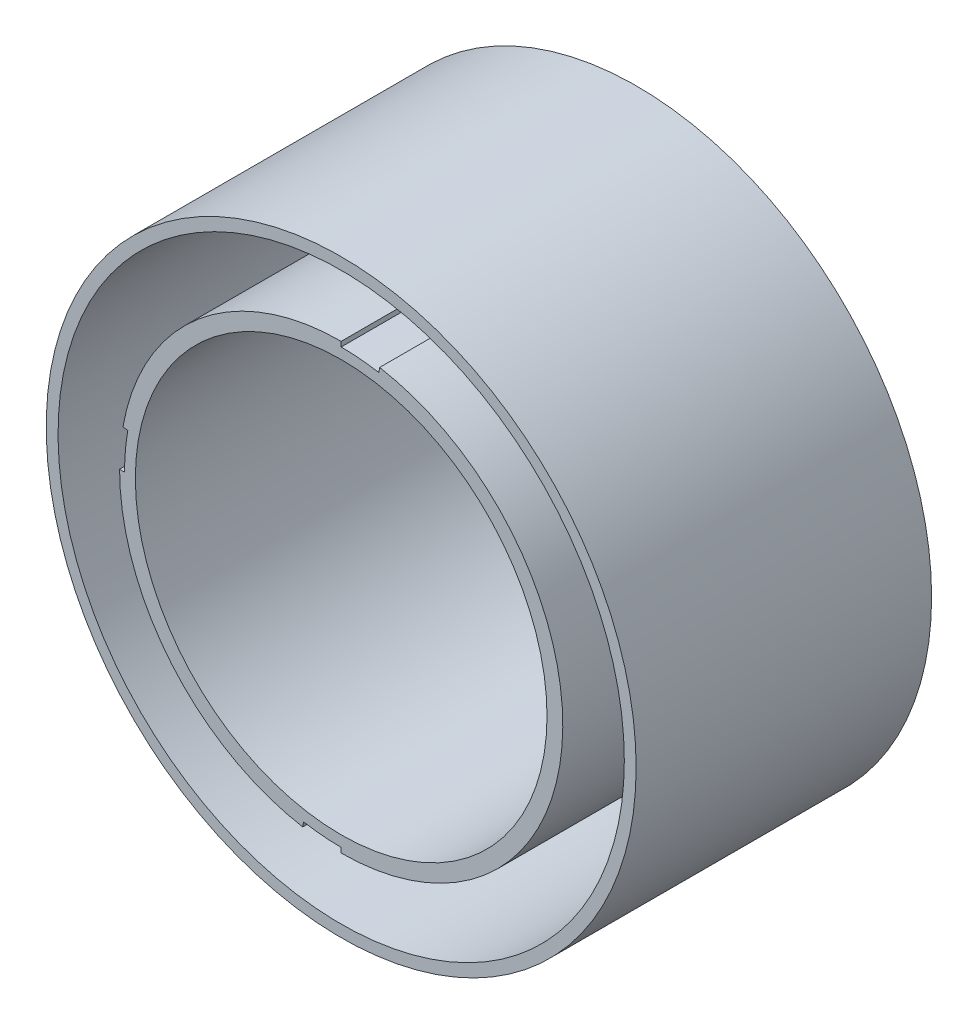
ISO-10303-21;
HEADER;
FILE_DESCRIPTION(('STEP AP214'),'2;1');
FILE_NAME('part.step','',(''),(''),'','','');
FILE_SCHEMA(('AUTOMOTIVE_DESIGN { 1 0 10303 214 1 1 1 1 }'));
ENDSEC;
DATA;
#1=APPLICATION_CONTEXT('core data for automotive mechanical design processes');
#2=APPLICATION_PROTOCOL_DEFINITION('international standard','automotive_design',2000,#1);
#3=PRODUCT_CONTEXT('',#1,'mechanical');
#4=PRODUCT('Part','Part','',(#3));
#5=PRODUCT_RELATED_PRODUCT_CATEGORY('part','',(#4));
#6=PRODUCT_DEFINITION_FORMATION('','',#4);
#7=PRODUCT_DEFINITION_CONTEXT('part definition',#1,'design');
#8=PRODUCT_DEFINITION('design','',#6,#7);
#9=PRODUCT_DEFINITION_SHAPE('','',#8);
#10=(LENGTH_UNIT() NAMED_UNIT(*) SI_UNIT(.MILLI.,.METRE.));
#11=(NAMED_UNIT(*) PLANE_ANGLE_UNIT() SI_UNIT($,.RADIAN.));
#12=(NAMED_UNIT(*) SI_UNIT($,.STERADIAN.) SOLID_ANGLE_UNIT());
#13=UNCERTAINTY_MEASURE_WITH_UNIT(LENGTH_MEASURE(1.E-05),#10,'distance_accuracy_value','');
#14=(GEOMETRIC_REPRESENTATION_CONTEXT(3) GLOBAL_UNCERTAINTY_ASSIGNED_CONTEXT((#13)) GLOBAL_UNIT_ASSIGNED_CONTEXT((#10,
#11,#12)) REPRESENTATION_CONTEXT('',''));
#15=CARTESIAN_POINT('',(0.,0.,0.));
#16=DIRECTION('',(0.,0.,1.));
#17=DIRECTION('',(1.,0.,0.));
#18=AXIS2_PLACEMENT_3D('',#15,#16,#17);
#19=CARTESIAN_POINT('',(0.,0.,30.));
#20=DIRECTION('',(0.,0.,-1.));
#21=DIRECTION('',(-1.,0.,0.));
#22=AXIS2_PLACEMENT_3D('',#19,#20,#21);
#23=CYLINDRICAL_SURFACE('',#22,28.75);
#24=CARTESIAN_POINT('',(0.,0.,30.));
#25=DIRECTION('',(0.,0.,1.));
#26=DIRECTION('',(1.,0.,0.));
#27=AXIS2_PLACEMENT_3D('',#24,#25,#26);
#28=CIRCLE('',#27,28.75);
#29=CARTESIAN_POINT('',(28.75,0.,30.));
#30=VERTEX_POINT('',#29);
#31=EDGE_CURVE('E56',#30,#30,#28,.T.);
#32=ORIENTED_EDGE('',*,*,#31,.T.);
#33=EDGE_LOOP('',(#32));
#34=FACE_BOUND('',#33,.T.);
#35=CARTESIAN_POINT('',(0.,0.,0.));
#36=DIRECTION('',(0.,0.,1.));
#37=DIRECTION('',(1.,0.,0.));
#38=AXIS2_PLACEMENT_3D('',#35,#36,#37);
#39=CIRCLE('',#38,28.75);
#40=CARTESIAN_POINT('',(-22.9600254219505,17.3031711724582,0.));
#41=VERTEX_POINT('',#40);
#42=CARTESIAN_POINT('',(-22.9600254219505,-17.3031711724582,0.));
#43=VERTEX_POINT('',#42);
#44=EDGE_CURVE('E527',#41,#43,#39,.T.);
#45=ORIENTED_EDGE('',*,*,#44,.F.);
#46=DIRECTION('',(0.,0.,-1.));
#47=VECTOR('',#46,1.);
#48=CARTESIAN_POINT('',(-22.9600254219505,17.3031711724582,30.));
#49=LINE('',#48,#47);
#50=CARTESIAN_POINT('',(-22.9600254219505,17.3031711724582,4.));
#51=VERTEX_POINT('',#50);
#52=EDGE_CURVE('E259',#41,#51,#49,.F.);
#53=ORIENTED_EDGE('',*,*,#52,.T.);
#54=CARTESIAN_POINT('',(0.,0.,4.));
#55=DIRECTION('',(0.,0.,-1.));
#56=DIRECTION('',(-1.,0.,0.));
#57=AXIS2_PLACEMENT_3D('',#54,#55,#56);
#58=CIRCLE('',#57,28.75);
#59=CARTESIAN_POINT('',(-17.3031711724581,22.9600254219506,4.));
#60=VERTEX_POINT('',#59);
#61=EDGE_CURVE('E255',#51,#60,#58,.T.);
#62=ORIENTED_EDGE('',*,*,#61,.T.);
#63=DIRECTION('',(0.,0.,-1.));
#64=VECTOR('',#63,1.);
#65=CARTESIAN_POINT('',(-17.3031711724581,22.9600254219506,30.));
#66=LINE('',#65,#64);
#67=CARTESIAN_POINT('',(-17.3031711724581,22.9600254219506,0.));
#68=VERTEX_POINT('',#67);
#69=EDGE_CURVE('E278',#60,#68,#66,.T.);
#70=ORIENTED_EDGE('',*,*,#69,.T.);
#71=CARTESIAN_POINT('',(17.3031711724581,22.9600254219506,0.));
#72=VERTEX_POINT('',#71);
#73=EDGE_CURVE('E524',#72,#68,#39,.T.);
#74=ORIENTED_EDGE('',*,*,#73,.F.);
#75=DIRECTION('',(0.,0.,-1.));
#76=VECTOR('',#75,1.);
#77=CARTESIAN_POINT('',(17.3031711724581,22.9600254219506,30.));
#78=LINE('',#77,#76);
#79=CARTESIAN_POINT('',(17.3031711724581,22.9600254219506,4.));
#80=VERTEX_POINT('',#79);
#81=EDGE_CURVE('E513',#80,#72,#78,.T.);
#82=ORIENTED_EDGE('',*,*,#81,.F.);
#83=CARTESIAN_POINT('',(0.,0.,4.));
#84=DIRECTION('',(0.,0.,-1.));
#85=DIRECTION('',(-1.,0.,0.));
#86=AXIS2_PLACEMENT_3D('',#83,#84,#85);
#87=CIRCLE('',#86,28.75);
#88=CARTESIAN_POINT('',(22.9600254219505,17.3031711724582,4.));
#89=VERTEX_POINT('',#88);
#90=EDGE_CURVE('E517',#80,#89,#87,.T.);
#91=ORIENTED_EDGE('',*,*,#90,.T.);
#92=DIRECTION('',(0.,0.,-1.));
#93=VECTOR('',#92,1.);
#94=CARTESIAN_POINT('',(22.9600254219505,17.3031711724582,30.));
#95=LINE('',#94,#93);
#96=CARTESIAN_POINT('',(22.9600254219505,17.3031711724582,0.));
#97=VERTEX_POINT('',#96);
#98=EDGE_CURVE('E507',#97,#89,#95,.F.);
#99=ORIENTED_EDGE('',*,*,#98,.F.);
#100=CARTESIAN_POINT('',(22.9600254219505,-17.3031711724582,0.));
#101=VERTEX_POINT('',#100);
#102=EDGE_CURVE('E521',#101,#97,#39,.T.);
#103=ORIENTED_EDGE('',*,*,#102,.F.);
#104=DIRECTION('',(0.,0.,-1.));
#105=VECTOR('',#104,1.);
#106=CARTESIAN_POINT('',(22.9600254219505,-17.3031711724582,30.));
#107=LINE('',#106,#105);
#108=CARTESIAN_POINT('',(22.9600254219505,-17.3031711724582,4.));
#109=VERTEX_POINT('',#108);
#110=EDGE_CURVE('E358',#101,#109,#107,.F.);
#111=ORIENTED_EDGE('',*,*,#110,.T.);
#112=CARTESIAN_POINT('',(0.,0.,4.));
#113=DIRECTION('',(0.,0.,-1.));
#114=DIRECTION('',(-1.,0.,0.));
#115=AXIS2_PLACEMENT_3D('',#112,#113,#114);
#116=CIRCLE('',#115,28.75);
#117=CARTESIAN_POINT('',(17.3031711724581,-22.9600254219505,4.));
#118=VERTEX_POINT('',#117);
#119=EDGE_CURVE('E347',#109,#118,#116,.T.);
#120=ORIENTED_EDGE('',*,*,#119,.T.);
#121=DIRECTION('',(0.,0.,-1.));
#122=VECTOR('',#121,1.);
#123=CARTESIAN_POINT('',(17.3031711724581,-22.9600254219505,30.));
#124=LINE('',#123,#122);
#125=CARTESIAN_POINT('',(17.3031711724581,-22.9600254219505,0.));
#126=VERTEX_POINT('',#125);
#127=EDGE_CURVE('E354',#118,#126,#124,.T.);
#128=ORIENTED_EDGE('',*,*,#127,.T.);
#129=CARTESIAN_POINT('',(-17.3031711724581,-22.9600254219505,0.));
#130=VERTEX_POINT('',#129);
#131=EDGE_CURVE('E534',#130,#126,#39,.T.);
#132=ORIENTED_EDGE('',*,*,#131,.F.);
#133=DIRECTION('',(0.,0.,-1.));
#134=VECTOR('',#133,1.);
#135=CARTESIAN_POINT('',(-17.3031711724581,-22.9600254219505,30.));
#136=LINE('',#135,#134);
#137=CARTESIAN_POINT('',(-17.3031711724581,-22.9600254219505,4.));
#138=VERTEX_POINT('',#137);
#139=EDGE_CURVE('E315',#138,#130,#136,.T.);
#140=ORIENTED_EDGE('',*,*,#139,.F.);
#141=CARTESIAN_POINT('',(0.,0.,4.));
#142=DIRECTION('',(0.,0.,-1.));
#143=DIRECTION('',(-1.,0.,0.));
#144=AXIS2_PLACEMENT_3D('',#141,#142,#143);
#145=CIRCLE('',#144,28.75);
#146=CARTESIAN_POINT('',(-22.9600254219505,-17.3031711724582,4.));
#147=VERTEX_POINT('',#146);
#148=EDGE_CURVE('E308',#138,#147,#145,.T.);
#149=ORIENTED_EDGE('',*,*,#148,.T.);
#150=DIRECTION('',(0.,0.,-1.));
#151=VECTOR('',#150,1.);
#152=CARTESIAN_POINT('',(-22.9600254219505,-17.3031711724582,30.));
#153=LINE('',#152,#151);
#154=EDGE_CURVE('E319',#43,#147,#153,.F.);
#155=ORIENTED_EDGE('',*,*,#154,.F.);
#156=EDGE_LOOP('',(#45,#53,#62,#70,#74,#82,#91,#99,#103,#111,#120,#128,#132,#140,#149,#155));
#157=FACE_BOUND('',#156,.T.);
#158=ADVANCED_FACE('F47',(#34,#157),#23,.F.);
#159=CARTESIAN_POINT('',(0.,0.,30.));
#160=DIRECTION('',(0.,0.,-1.));
#161=DIRECTION('',(-1.,0.,0.));
#162=AXIS2_PLACEMENT_3D('',#159,#160,#161);
#163=CYLINDRICAL_SURFACE('',#162,22.5);
#164=DIRECTION('',(0.,0.,-1.));
#165=VECTOR('',#164,1.);
#166=CARTESIAN_POINT('',(-18.4848954365973,12.828041187105,4.));
#167=LINE('',#166,#165);
#168=CARTESIAN_POINT('',(-18.4848954365973,12.828041187105,4.));
#169=VERTEX_POINT('',#168);
#170=CARTESIAN_POINT('',(-18.4848954365973,12.828041187105,0.));
#171=VERTEX_POINT('',#170);
#172=EDGE_CURVE('E248',#169,#171,#167,.T.);
#173=ORIENTED_EDGE('',*,*,#172,.T.);
#174=CARTESIAN_POINT('',(0.,0.,0.));
#175=DIRECTION('',(0.,0.,1.));
#176=DIRECTION('',(1.,0.,0.));
#177=AXIS2_PLACEMENT_3D('',#174,#175,#176);
#178=CIRCLE('',#177,22.5);
#179=CARTESIAN_POINT('',(-22.1581744427747,3.90708399750594,0.));
#180=VERTEX_POINT('',#179);
#181=EDGE_CURVE('E232',#171,#180,#178,.T.);
#182=ORIENTED_EDGE('',*,*,#181,.T.);
#183=DIRECTION('',(0.,0.,1.));
#184=VECTOR('',#183,1.);
#185=CARTESIAN_POINT('',(-22.1581744427747,3.90708399750594,0.));
#186=LINE('',#185,#184);
#187=CARTESIAN_POINT('',(-22.1581744427747,3.90708399750594,30.));
#188=VERTEX_POINT('',#187);
#189=EDGE_CURVE('E437',#180,#188,#186,.T.);
#190=ORIENTED_EDGE('',*,*,#189,.T.);
#191=CARTESIAN_POINT('',(0.,0.,30.));
#192=DIRECTION('',(0.,0.,1.));
#193=DIRECTION('',(1.,0.,0.));
#194=AXIS2_PLACEMENT_3D('',#191,#192,#193);
#195=CIRCLE('',#194,22.5);
#196=CARTESIAN_POINT('',(0.,22.5,30.));
#197=VERTEX_POINT('',#196);
#198=EDGE_CURVE('E477',#197,#188,#195,.T.);
#199=ORIENTED_EDGE('',*,*,#198,.F.);
#200=DIRECTION('',(0.,0.,1.));
#201=VECTOR('',#200,1.);
#202=CARTESIAN_POINT('',(0.,22.5,0.));
#203=LINE('',#202,#201);
#204=CARTESIAN_POINT('',(0.,22.5,0.));
#205=VERTEX_POINT('',#204);
#206=EDGE_CURVE('E388',#205,#197,#203,.T.);
#207=ORIENTED_EDGE('',*,*,#206,.F.);
#208=CARTESIAN_POINT('',(-12.828041187105,18.4848954365974,0.));
#209=VERTEX_POINT('',#208);
#210=EDGE_CURVE('E242',#205,#209,#178,.T.);
#211=ORIENTED_EDGE('',*,*,#210,.T.);
#212=DIRECTION('',(0.,0.,-1.));
#213=VECTOR('',#212,1.);
#214=CARTESIAN_POINT('',(-12.828041187105,18.4848954365974,4.));
#215=LINE('',#214,#213);
#216=CARTESIAN_POINT('',(-12.828041187105,18.4848954365974,4.));
#217=VERTEX_POINT('',#216);
#218=EDGE_CURVE('E72',#217,#209,#215,.T.);
#219=ORIENTED_EDGE('',*,*,#218,.F.);
#220=CARTESIAN_POINT('',(0.,0.,4.));
#221=DIRECTION('',(0.,0.,-1.));
#222=DIRECTION('',(-1.,0.,0.));
#223=AXIS2_PLACEMENT_3D('',#220,#221,#222);
#224=CIRCLE('',#223,22.5);
#225=EDGE_CURVE('E250',#169,#217,#224,.T.);
#226=ORIENTED_EDGE('',*,*,#225,.F.);
#227=EDGE_LOOP('',(#173,#182,#190,#199,#207,#211,#219,#226));
#228=FACE_BOUND('',#227,.T.);
#229=ADVANCED_FACE('F249',(#228),#163,.T.);
#230=DIRECTION('',(0.,0.,-1.));
#231=VECTOR('',#230,1.);
#232=CARTESIAN_POINT('',(18.4848954365973,-12.828041187105,4.));
#233=LINE('',#232,#231);
#234=CARTESIAN_POINT('',(18.4848954365973,-12.828041187105,4.));
#235=VERTEX_POINT('',#234);
#236=CARTESIAN_POINT('',(18.4848954365973,-12.828041187105,0.));
#237=VERTEX_POINT('',#236);
#238=EDGE_CURVE('E343',#235,#237,#233,.T.);
#239=ORIENTED_EDGE('',*,*,#238,.T.);
#240=CARTESIAN_POINT('',(18.4848954365973,12.828041187105,0.));
#241=VERTEX_POINT('',#240);
#242=EDGE_CURVE('E483',#237,#241,#178,.T.);
#243=ORIENTED_EDGE('',*,*,#242,.T.);
#244=DIRECTION('',(0.,0.,-1.));
#245=VECTOR('',#244,1.);
#246=CARTESIAN_POINT('',(18.4848954365973,12.828041187105,4.));
#247=LINE('',#246,#245);
#248=CARTESIAN_POINT('',(18.4848954365973,12.828041187105,4.));
#249=VERTEX_POINT('',#248);
#250=EDGE_CURVE('E497',#249,#241,#247,.T.);
#251=ORIENTED_EDGE('',*,*,#250,.F.);
#252=CARTESIAN_POINT('',(0.,0.,4.));
#253=DIRECTION('',(0.,0.,-1.));
#254=DIRECTION('',(-1.,0.,0.));
#255=AXIS2_PLACEMENT_3D('',#252,#253,#254);
#256=CIRCLE('',#255,22.5);
#257=CARTESIAN_POINT('',(12.828041187105,18.4848954365974,4.));
#258=VERTEX_POINT('',#257);
#259=EDGE_CURVE('E488',#258,#249,#256,.T.);
#260=ORIENTED_EDGE('',*,*,#259,.F.);
#261=DIRECTION('',(0.,0.,-1.));
#262=VECTOR('',#261,1.);
#263=CARTESIAN_POINT('',(12.828041187105,18.4848954365974,4.));
#264=LINE('',#263,#262);
#265=CARTESIAN_POINT('',(12.828041187105,18.4848954365974,0.));
#266=VERTEX_POINT('',#265);
#267=EDGE_CURVE('E504',#258,#266,#264,.T.);
#268=ORIENTED_EDGE('',*,*,#267,.T.);
#269=CARTESIAN_POINT('',(3.90708399750596,22.1581744427747,0.));
#270=VERTEX_POINT('',#269);
#271=EDGE_CURVE('E480',#266,#270,#178,.T.);
#272=ORIENTED_EDGE('',*,*,#271,.T.);
#273=DIRECTION('',(0.,0.,1.));
#274=VECTOR('',#273,1.);
#275=CARTESIAN_POINT('',(3.90708399750596,22.1581744427747,0.));
#276=LINE('',#275,#274);
#277=CARTESIAN_POINT('',(3.90708399750596,22.1581744427747,30.));
#278=VERTEX_POINT('',#277);
#279=EDGE_CURVE('E392',#270,#278,#276,.T.);
#280=ORIENTED_EDGE('',*,*,#279,.T.);
#281=CARTESIAN_POINT('',(0.,-22.5,30.));
#282=VERTEX_POINT('',#281);
#283=EDGE_CURVE('E472',#282,#278,#195,.T.);
#284=ORIENTED_EDGE('',*,*,#283,.F.);
#285=DIRECTION('',(0.,0.,1.));
#286=VECTOR('',#285,1.);
#287=CARTESIAN_POINT('',(0.,-22.5,0.));
#288=LINE('',#287,#286);
#289=CARTESIAN_POINT('',(0.,-22.5,0.));
#290=VERTEX_POINT('',#289);
#291=EDGE_CURVE('E406',#290,#282,#288,.T.);
#292=ORIENTED_EDGE('',*,*,#291,.F.);
#293=CARTESIAN_POINT('',(12.828041187105,-18.4848954365974,0.));
#294=VERTEX_POINT('',#293);
#295=EDGE_CURVE('E246',#290,#294,#178,.T.);
#296=ORIENTED_EDGE('',*,*,#295,.T.);
#297=DIRECTION('',(0.,0.,-1.));
#298=VECTOR('',#297,1.);
#299=CARTESIAN_POINT('',(12.828041187105,-18.4848954365974,4.));
#300=LINE('',#299,#298);
#301=CARTESIAN_POINT('',(12.828041187105,-18.4848954365974,4.));
#302=VERTEX_POINT('',#301);
#303=EDGE_CURVE('E336',#302,#294,#300,.T.);
#304=ORIENTED_EDGE('',*,*,#303,.F.);
#305=CARTESIAN_POINT('',(0.,0.,4.));
#306=DIRECTION('',(0.,0.,-1.));
#307=DIRECTION('',(-1.,0.,0.));
#308=AXIS2_PLACEMENT_3D('',#305,#306,#307);
#309=CIRCLE('',#308,22.5);
#310=EDGE_CURVE('E332',#235,#302,#309,.T.);
#311=ORIENTED_EDGE('',*,*,#310,.F.);
#312=EDGE_LOOP('',(#239,#243,#251,#260,#268,#272,#280,#284,#292,#296,#304,#311));
#313=FACE_BOUND('',#312,.T.);
#314=ADVANCED_FACE('F557',(#313),#163,.T.);
#315=CARTESIAN_POINT('',(0.,0.,30.));
#316=DIRECTION('',(0.,0.,-1.));
#317=DIRECTION('',(-1.,0.,0.));
#318=AXIS2_PLACEMENT_3D('',#315,#316,#317);
#319=CYLINDRICAL_SURFACE('',#318,29.95);
#320=CARTESIAN_POINT('',(0.,0.,0.));
#321=DIRECTION('',(0.,0.,1.));
#322=DIRECTION('',(1.,0.,0.));
#323=AXIS2_PLACEMENT_3D('',#320,#321,#322);
#324=CIRCLE('',#323,29.95);
#325=CARTESIAN_POINT('',(29.95,0.,0.));
#326=VERTEX_POINT('',#325);
#327=EDGE_CURVE('E50',#326,#326,#324,.T.);
#328=ORIENTED_EDGE('',*,*,#327,.T.);
#329=EDGE_LOOP('',(#328));
#330=FACE_BOUND('',#329,.T.);
#331=CARTESIAN_POINT('',(0.,0.,30.));
#332=DIRECTION('',(0.,0.,1.));
#333=DIRECTION('',(1.,0.,0.));
#334=AXIS2_PLACEMENT_3D('',#331,#332,#333);
#335=CIRCLE('',#334,29.95);
#336=CARTESIAN_POINT('',(29.95,0.,30.));
#337=VERTEX_POINT('',#336);
#338=EDGE_CURVE('E12',#337,#337,#335,.T.);
#339=ORIENTED_EDGE('',*,*,#338,.F.);
#340=EDGE_LOOP('',(#339));
#341=FACE_BOUND('',#340,.T.);
#342=ADVANCED_FACE('F654',(#330,#341),#319,.T.);
#343=CARTESIAN_POINT('',(0.,0.,30.));
#344=DIRECTION('',(0.,0.,1.));
#345=DIRECTION('',(1.,0.,0.));
#346=AXIS2_PLACEMENT_3D('',#343,#344,#345);
#347=PLANE('',#346);
#348=ORIENTED_EDGE('',*,*,#31,.F.);
#349=EDGE_LOOP('',(#348));
#350=FACE_BOUND('',#349,.T.);
#351=ORIENTED_EDGE('',*,*,#338,.T.);
#352=EDGE_LOOP('',(#351));
#353=FACE_BOUND('',#352,.T.);
#354=ADVANCED_FACE('F651',(#350,#353),#347,.T.);
#355=CARTESIAN_POINT('',(0.,0.,0.));
#356=DIRECTION('',(0.,0.,1.));
#357=DIRECTION('',(1.,0.,0.));
#358=AXIS2_PLACEMENT_3D('',#355,#356,#357);
#359=PLANE('',#358);
#360=ORIENTED_EDGE('',*,*,#73,.T.);
#361=DIRECTION('',(-0.707106781186546,0.707106781186549,0.));
#362=VECTOR('',#361,1.);
#363=CARTESIAN_POINT('',(2.82842712474619,2.82842712474618,0.));
#364=LINE('',#363,#362);
#365=EDGE_CURVE('E263',#209,#68,#364,.T.);
#366=ORIENTED_EDGE('',*,*,#365,.F.);
#367=ORIENTED_EDGE('',*,*,#210,.F.);
#368=DIRECTION('',(0.,-1.,0.));
#369=VECTOR('',#368,1.);
#370=CARTESIAN_POINT('',(0.,0.,0.));
#371=LINE('',#370,#369);
#372=CARTESIAN_POINT('',(0.,21.9997869262171,0.));
#373=VERTEX_POINT('',#372);
#374=EDGE_CURVE('E363',#205,#373,#371,.T.);
#375=ORIENTED_EDGE('',*,*,#374,.T.);
#376=CARTESIAN_POINT('',(0.,0.,0.));
#377=DIRECTION('',(0.,0.,1.));
#378=DIRECTION('',(1.,0.,0.));
#379=AXIS2_PLACEMENT_3D('',#376,#377,#378);
#380=CIRCLE('',#379,21.9997869262171);
#381=CARTESIAN_POINT('',(3.82022290879838,21.6655607295552,0.));
#382=VERTEX_POINT('',#381);
#383=EDGE_CURVE('E367',#373,#382,#380,.F.);
#384=ORIENTED_EDGE('',*,*,#383,.T.);
#385=DIRECTION('',(0.173648177666931,0.984807753012208,0.));
#386=VECTOR('',#385,1.);
#387=CARTESIAN_POINT('',(0.,0.,0.));
#388=LINE('',#387,#386);
#389=EDGE_CURVE('E372',#382,#270,#388,.T.);
#390=ORIENTED_EDGE('',*,*,#389,.T.);
#391=ORIENTED_EDGE('',*,*,#271,.F.);
#392=DIRECTION('',(0.707106781186546,0.707106781186549,0.));
#393=VECTOR('',#392,1.);
#394=CARTESIAN_POINT('',(-2.82842712474619,2.82842712474618,0.));
#395=LINE('',#394,#393);
#396=EDGE_CURVE('E489',#266,#72,#395,.T.);
#397=ORIENTED_EDGE('',*,*,#396,.T.);
#398=EDGE_LOOP('',(#360,#366,#367,#375,#384,#390,#391,#397));
#399=FACE_BOUND('',#398,.T.);
#400=ORIENTED_EDGE('',*,*,#327,.F.);
#401=EDGE_LOOP('',(#400));
#402=FACE_BOUND('',#401,.T.);
#403=DIRECTION('',(0.707106781186546,-0.707106781186549,0.));
#404=VECTOR('',#403,1.);
#405=CARTESIAN_POINT('',(-2.82842712474619,-2.82842712474618,0.));
#406=LINE('',#405,#404);
#407=EDGE_CURVE('E64',#41,#171,#406,.T.);
#408=ORIENTED_EDGE('',*,*,#407,.F.);
#409=ORIENTED_EDGE('',*,*,#44,.T.);
#410=DIRECTION('',(0.707106781186546,0.707106781186549,0.));
#411=VECTOR('',#410,1.);
#412=CARTESIAN_POINT('',(-2.82842712474619,2.82842712474618,0.));
#413=LINE('',#412,#411);
#414=CARTESIAN_POINT('',(-18.4848954365973,-12.828041187105,0.));
#415=VERTEX_POINT('',#414);
#416=EDGE_CURVE('E290',#43,#415,#413,.T.);
#417=ORIENTED_EDGE('',*,*,#416,.T.);
#418=CARTESIAN_POINT('',(-22.5,2.32571621395489E-13,0.));
#419=VERTEX_POINT('',#418);
#420=EDGE_CURVE('E243',#419,#415,#178,.T.);
#421=ORIENTED_EDGE('',*,*,#420,.F.);
#422=DIRECTION('',(1.,-4.79228349341611E-13,0.));
#423=VECTOR('',#422,1.);
#424=CARTESIAN_POINT('',(-22.5,2.35674990371912E-13,0.));
#425=LINE('',#424,#423);
#426=CARTESIAN_POINT('',(-21.9997869262171,1.05429215745182E-11,0.));
#427=VERTEX_POINT('',#426);
#428=EDGE_CURVE('E462',#419,#427,#425,.T.);
#429=ORIENTED_EDGE('',*,*,#428,.T.);
#430=CARTESIAN_POINT('',(0.,0.,0.));
#431=DIRECTION('',(0.,0.,1.));
#432=DIRECTION('',(1.,0.,0.));
#433=AXIS2_PLACEMENT_3D('',#430,#431,#432);
#434=CIRCLE('',#433,21.9997869262171);
#435=CARTESIAN_POINT('',(-21.6655607295552,3.82022290879836,0.));
#436=VERTEX_POINT('',#435);
#437=EDGE_CURVE('E440',#436,#427,#434,.T.);
#438=ORIENTED_EDGE('',*,*,#437,.F.);
#439=DIRECTION('',(-0.984807753012208,0.173648177666932,0.));
#440=VECTOR('',#439,1.);
#441=CARTESIAN_POINT('',(-21.6655607295552,3.82022290879836,0.));
#442=LINE('',#441,#440);
#443=EDGE_CURVE('E238',#436,#180,#442,.T.);
#444=ORIENTED_EDGE('',*,*,#443,.T.);
#445=ORIENTED_EDGE('',*,*,#181,.F.);
#446=EDGE_LOOP('',(#408,#409,#417,#421,#429,#438,#444,#445));
#447=FACE_BOUND('',#446,.T.);
#448=DIRECTION('',(-0.707106781186546,0.707106781186549,0.));
#449=VECTOR('',#448,1.);
#450=CARTESIAN_POINT('',(2.82842712474619,2.82842712474618,0.));
#451=LINE('',#450,#449);
#452=EDGE_CURVE('E322',#101,#237,#451,.T.);
#453=ORIENTED_EDGE('',*,*,#452,.F.);
#454=ORIENTED_EDGE('',*,*,#102,.T.);
#455=DIRECTION('',(-0.707106781186546,-0.707106781186549,0.));
#456=VECTOR('',#455,1.);
#457=CARTESIAN_POINT('',(2.82842712474619,-2.82842712474618,0.));
#458=LINE('',#457,#456);
#459=EDGE_CURVE('E498',#97,#241,#458,.T.);
#460=ORIENTED_EDGE('',*,*,#459,.T.);
#461=ORIENTED_EDGE('',*,*,#242,.F.);
#462=EDGE_LOOP('',(#453,#454,#460,#461));
#463=FACE_BOUND('',#462,.T.);
#464=CARTESIAN_POINT('',(0.,0.,0.));
#465=DIRECTION('',(0.,0.,1.));
#466=DIRECTION('',(1.,0.,0.));
#467=AXIS2_PLACEMENT_3D('',#464,#465,#466);
#468=CIRCLE('',#467,20.9);
#469=CARTESIAN_POINT('',(20.9,0.,0.));
#470=VERTEX_POINT('',#469);
#471=EDGE_CURVE('E391',#470,#470,#468,.T.);
#472=ORIENTED_EDGE('',*,*,#471,.T.);
#473=EDGE_LOOP('',(#472));
#474=FACE_BOUND('',#473,.T.);
#475=DIRECTION('',(-0.707106781186546,-0.707106781186549,0.));
#476=VECTOR('',#475,1.);
#477=CARTESIAN_POINT('',(2.82842712474619,-2.82842712474618,0.));
#478=LINE('',#477,#476);
#479=CARTESIAN_POINT('',(-12.828041187105,-18.4848954365974,0.));
#480=VERTEX_POINT('',#479);
#481=EDGE_CURVE('E284',#480,#130,#478,.T.);
#482=ORIENTED_EDGE('',*,*,#481,.T.);
#483=ORIENTED_EDGE('',*,*,#131,.T.);
#484=DIRECTION('',(0.707106781186546,-0.707106781186549,0.));
#485=VECTOR('',#484,1.);
#486=CARTESIAN_POINT('',(-2.82842712474619,-2.82842712474618,0.));
#487=LINE('',#486,#485);
#488=EDGE_CURVE('E328',#294,#126,#487,.T.);
#489=ORIENTED_EDGE('',*,*,#488,.F.);
#490=ORIENTED_EDGE('',*,*,#295,.F.);
#491=DIRECTION('',(0.,1.,0.));
#492=VECTOR('',#491,1.);
#493=CARTESIAN_POINT('',(0.,-22.5,0.));
#494=LINE('',#493,#492);
#495=CARTESIAN_POINT('',(0.,-21.9997869262171,0.));
#496=VERTEX_POINT('',#495);
#497=EDGE_CURVE('E430',#290,#496,#494,.T.);
#498=ORIENTED_EDGE('',*,*,#497,.T.);
#499=CARTESIAN_POINT('',(0.,0.,0.));
#500=DIRECTION('',(0.,0.,1.));
#501=DIRECTION('',(1.,0.,0.));
#502=AXIS2_PLACEMENT_3D('',#499,#500,#501);
#503=CIRCLE('',#502,21.9997869262171);
#504=CARTESIAN_POINT('',(-3.82022290879836,-21.6655607295552,0.));
#505=VERTEX_POINT('',#504);
#506=EDGE_CURVE('E405',#505,#496,#503,.T.);
#507=ORIENTED_EDGE('',*,*,#506,.F.);
#508=DIRECTION('',(-0.173648177666932,-0.984807753012208,0.));
#509=VECTOR('',#508,1.);
#510=CARTESIAN_POINT('',(-3.82022290879836,-21.6655607295552,0.));
#511=LINE('',#510,#509);
#512=CARTESIAN_POINT('',(-3.90708399750595,-22.1581744427747,0.));
#513=VERTEX_POINT('',#512);
#514=EDGE_CURVE('E421',#505,#513,#511,.T.);
#515=ORIENTED_EDGE('',*,*,#514,.T.);
#516=EDGE_CURVE('E245',#480,#513,#178,.T.);
#517=ORIENTED_EDGE('',*,*,#516,.F.);
#518=EDGE_LOOP('',(#482,#483,#489,#490,#498,#507,#515,#517));
#519=FACE_BOUND('',#518,.T.);
#520=ADVANCED_FACE('F234',(#399,#402,#447,#463,#474,#519),#359,.F.);
#521=CARTESIAN_POINT('',(0.,0.,4.));
#522=DIRECTION('',(0.,0.,-1.));
#523=DIRECTION('',(-1.,0.,0.));
#524=AXIS2_PLACEMENT_3D('',#521,#522,#523);
#525=PLANE('',#524);
#526=ORIENTED_EDGE('',*,*,#90,.F.);
#527=DIRECTION('',(0.707106781186546,0.707106781186549,0.));
#528=VECTOR('',#527,1.);
#529=CARTESIAN_POINT('',(-2.82842712474619,2.82842712474618,4.));
#530=LINE('',#529,#528);
#531=EDGE_CURVE('E493',#258,#80,#530,.T.);
#532=ORIENTED_EDGE('',*,*,#531,.F.);
#533=ORIENTED_EDGE('',*,*,#259,.T.);
#534=DIRECTION('',(-0.707106781186546,-0.707106781186549,0.));
#535=VECTOR('',#534,1.);
#536=CARTESIAN_POINT('',(2.82842712474619,-2.82842712474618,4.));
#537=LINE('',#536,#535);
#538=EDGE_CURVE('E484',#89,#249,#537,.T.);
#539=ORIENTED_EDGE('',*,*,#538,.F.);
#540=EDGE_LOOP('',(#526,#532,#533,#539));
#541=FACE_BOUND('',#540,.T.);
#542=ADVANCED_FACE('F665',(#541),#525,.F.);
#543=CARTESIAN_POINT('',(-2.82842712474619,2.82842712474618,4.));
#544=DIRECTION('',(-0.707106781186549,0.707106781186546,0.));
#545=DIRECTION('',(-0.707106781186546,-0.707106781186549,0.));
#546=AXIS2_PLACEMENT_3D('',#543,#544,#545);
#547=PLANE('',#546);
#548=ORIENTED_EDGE('',*,*,#531,.T.);
#549=ORIENTED_EDGE('',*,*,#81,.T.);
#550=ORIENTED_EDGE('',*,*,#396,.F.);
#551=ORIENTED_EDGE('',*,*,#267,.F.);
#552=EDGE_LOOP('',(#548,#549,#550,#551));
#553=FACE_BOUND('',#552,.T.);
#554=ADVANCED_FACE('F670',(#553),#547,.T.);
#555=CARTESIAN_POINT('',(2.82842712474619,-2.82842712474618,4.));
#556=DIRECTION('',(0.707106781186549,-0.707106781186546,0.));
#557=DIRECTION('',(0.707106781186546,0.707106781186549,0.));
#558=AXIS2_PLACEMENT_3D('',#555,#556,#557);
#559=PLANE('',#558);
#560=ORIENTED_EDGE('',*,*,#459,.F.);
#561=ORIENTED_EDGE('',*,*,#98,.T.);
#562=ORIENTED_EDGE('',*,*,#538,.T.);
#563=ORIENTED_EDGE('',*,*,#250,.T.);
#564=EDGE_LOOP('',(#560,#561,#562,#563));
#565=FACE_BOUND('',#564,.T.);
#566=ADVANCED_FACE('F667',(#565),#559,.T.);
#567=ORIENTED_EDGE('',*,*,#420,.T.);
#568=DIRECTION('',(0.,0.,-1.));
#569=VECTOR('',#568,1.);
#570=CARTESIAN_POINT('',(-18.4848954365973,-12.828041187105,4.));
#571=LINE('',#570,#569);
#572=CARTESIAN_POINT('',(-18.4848954365973,-12.828041187105,4.));
#573=VERTEX_POINT('',#572);
#574=EDGE_CURVE('E304',#573,#415,#571,.T.);
#575=ORIENTED_EDGE('',*,*,#574,.F.);
#576=CARTESIAN_POINT('',(0.,0.,4.));
#577=DIRECTION('',(0.,0.,-1.));
#578=DIRECTION('',(-1.,0.,0.));
#579=AXIS2_PLACEMENT_3D('',#576,#577,#578);
#580=CIRCLE('',#579,22.5);
#581=CARTESIAN_POINT('',(-12.828041187105,-18.4848954365974,4.));
#582=VERTEX_POINT('',#581);
#583=EDGE_CURVE('E285',#582,#573,#580,.T.);
#584=ORIENTED_EDGE('',*,*,#583,.F.);
#585=DIRECTION('',(0.,0.,-1.));
#586=VECTOR('',#585,1.);
#587=CARTESIAN_POINT('',(-12.828041187105,-18.4848954365974,4.));
#588=LINE('',#587,#586);
#589=EDGE_CURVE('E298',#582,#480,#588,.T.);
#590=ORIENTED_EDGE('',*,*,#589,.T.);
#591=ORIENTED_EDGE('',*,*,#516,.T.);
#592=DIRECTION('',(0.,0.,1.));
#593=VECTOR('',#592,1.);
#594=CARTESIAN_POINT('',(-3.90708399750595,-22.1581744427747,0.));
#595=LINE('',#594,#593);
#596=CARTESIAN_POINT('',(-3.90708399750595,-22.1581744427747,30.));
#597=VERTEX_POINT('',#596);
#598=EDGE_CURVE('E401',#513,#597,#595,.T.);
#599=ORIENTED_EDGE('',*,*,#598,.T.);
#600=CARTESIAN_POINT('',(-22.5,2.32571621395489E-13,30.));
#601=VERTEX_POINT('',#600);
#602=EDGE_CURVE('E476',#601,#597,#195,.T.);
#603=ORIENTED_EDGE('',*,*,#602,.F.);
#604=DIRECTION('',(0.,0.,1.));
#605=VECTOR('',#604,1.);
#606=CARTESIAN_POINT('',(-22.5,2.32571621395489E-13,0.));
#607=LINE('',#606,#605);
#608=EDGE_CURVE('E441',#419,#601,#607,.T.);
#609=ORIENTED_EDGE('',*,*,#608,.F.);
#610=EDGE_LOOP('',(#567,#575,#584,#590,#591,#599,#603,#609));
#611=FACE_BOUND('',#610,.T.);
#612=ADVANCED_FACE('F575',(#611),#163,.T.);
#613=CARTESIAN_POINT('',(0.,0.,30.));
#614=DIRECTION('',(0.,0.,-1.));
#615=DIRECTION('',(-1.,0.,0.));
#616=AXIS2_PLACEMENT_3D('',#613,#614,#615);
#617=CYLINDRICAL_SURFACE('',#616,20.9);
#618=CARTESIAN_POINT('',(0.,0.,30.));
#619=DIRECTION('',(0.,0.,1.));
#620=DIRECTION('',(1.,0.,0.));
#621=AXIS2_PLACEMENT_3D('',#618,#619,#620);
#622=CIRCLE('',#621,20.9);
#623=CARTESIAN_POINT('',(20.9,0.,30.));
#624=VERTEX_POINT('',#623);
#625=EDGE_CURVE('E468',#624,#624,#622,.T.);
#626=ORIENTED_EDGE('',*,*,#625,.T.);
#627=EDGE_LOOP('',(#626));
#628=FACE_BOUND('',#627,.T.);
#629=ORIENTED_EDGE('',*,*,#471,.F.);
#630=EDGE_LOOP('',(#629));
#631=FACE_BOUND('',#630,.T.);
#632=ADVANCED_FACE('F678',(#628,#631),#617,.F.);
#633=CARTESIAN_POINT('',(0.,0.,30.));
#634=DIRECTION('',(0.,0.,1.));
#635=DIRECTION('',(1.,0.,0.));
#636=AXIS2_PLACEMENT_3D('',#633,#634,#635);
#637=PLANE('',#636);
#638=DIRECTION('',(0.,-1.,0.));
#639=VECTOR('',#638,1.);
#640=CARTESIAN_POINT('',(0.,0.,30.));
#641=LINE('',#640,#639);
#642=CARTESIAN_POINT('',(0.,21.9997869262171,30.));
#643=VERTEX_POINT('',#642);
#644=EDGE_CURVE('E377',#197,#643,#641,.T.);
#645=ORIENTED_EDGE('',*,*,#644,.F.);
#646=ORIENTED_EDGE('',*,*,#198,.T.);
#647=DIRECTION('',(-0.984807753012208,0.173648177666932,0.));
#648=VECTOR('',#647,1.);
#649=CARTESIAN_POINT('',(-21.6655607295552,3.82022290879836,30.));
#650=LINE('',#649,#648);
#651=CARTESIAN_POINT('',(-21.6655607295552,3.82022290879836,30.));
#652=VERTEX_POINT('',#651);
#653=EDGE_CURVE('E415',#652,#188,#650,.T.);
#654=ORIENTED_EDGE('',*,*,#653,.F.);
#655=CARTESIAN_POINT('',(0.,0.,30.));
#656=DIRECTION('',(0.,0.,1.));
#657=DIRECTION('',(1.,0.,0.));
#658=AXIS2_PLACEMENT_3D('',#655,#656,#657);
#659=CIRCLE('',#658,21.9997869262171);
#660=CARTESIAN_POINT('',(-21.9997869262171,0.,30.));
#661=VERTEX_POINT('',#660);
#662=EDGE_CURVE('E449',#652,#661,#659,.T.);
#663=ORIENTED_EDGE('',*,*,#662,.T.);
#664=DIRECTION('',(1.,-4.79228349341611E-13,0.));
#665=VECTOR('',#664,1.);
#666=CARTESIAN_POINT('',(-22.5,2.35674990371912E-13,30.));
#667=LINE('',#666,#665);
#668=EDGE_CURVE('E453',#601,#661,#667,.T.);
#669=ORIENTED_EDGE('',*,*,#668,.F.);
#670=ORIENTED_EDGE('',*,*,#602,.T.);
#671=DIRECTION('',(-0.173648177666932,-0.984807753012208,0.));
#672=VECTOR('',#671,1.);
#673=CARTESIAN_POINT('',(-3.82022290879836,-21.6655607295552,30.));
#674=LINE('',#673,#672);
#675=CARTESIAN_POINT('',(-3.82022290879836,-21.6655607295552,30.));
#676=VERTEX_POINT('',#675);
#677=EDGE_CURVE('E382',#676,#597,#674,.T.);
#678=ORIENTED_EDGE('',*,*,#677,.F.);
#679=CARTESIAN_POINT('',(0.,0.,30.));
#680=DIRECTION('',(0.,0.,1.));
#681=DIRECTION('',(1.,0.,0.));
#682=AXIS2_PLACEMENT_3D('',#679,#680,#681);
#683=CIRCLE('',#682,21.9997869262171);
#684=CARTESIAN_POINT('',(0.,-21.9997869262171,30.));
#685=VERTEX_POINT('',#684);
#686=EDGE_CURVE('E416',#676,#685,#683,.T.);
#687=ORIENTED_EDGE('',*,*,#686,.T.);
#688=DIRECTION('',(0.,1.,0.));
#689=VECTOR('',#688,1.);
#690=CARTESIAN_POINT('',(0.,-22.5,30.));
#691=LINE('',#690,#689);
#692=EDGE_CURVE('E420',#282,#685,#691,.T.);
#693=ORIENTED_EDGE('',*,*,#692,.F.);
#694=ORIENTED_EDGE('',*,*,#283,.T.);
#695=DIRECTION('',(0.173648177666931,0.984807753012208,0.));
#696=VECTOR('',#695,1.);
#697=CARTESIAN_POINT('',(0.,0.,30.));
#698=LINE('',#697,#696);
#699=CARTESIAN_POINT('',(3.82022290879838,21.6655607295552,30.));
#700=VERTEX_POINT('',#699);
#701=EDGE_CURVE('E368',#700,#278,#698,.T.);
#702=ORIENTED_EDGE('',*,*,#701,.F.);
#703=CARTESIAN_POINT('',(0.,0.,30.));
#704=DIRECTION('',(0.,0.,1.));
#705=DIRECTION('',(1.,0.,0.));
#706=AXIS2_PLACEMENT_3D('',#703,#704,#705);
#707=CIRCLE('',#706,21.9997869262171);
#708=EDGE_CURVE('E381',#643,#700,#707,.F.);
#709=ORIENTED_EDGE('',*,*,#708,.F.);
#710=EDGE_LOOP('',(#645,#646,#654,#663,#669,#670,#678,#687,#693,#694,#702,#709));
#711=FACE_BOUND('',#710,.T.);
#712=ORIENTED_EDGE('',*,*,#625,.F.);
#713=EDGE_LOOP('',(#712));
#714=FACE_BOUND('',#713,.T.);
#715=ADVANCED_FACE('F617',(#711,#714),#637,.T.);
#716=CARTESIAN_POINT('',(-21.6655607295552,3.82022290879836,0.));
#717=DIRECTION('',(0.173648177666932,0.984807753012208,0.));
#718=DIRECTION('',(-0.984807753012208,0.173648177666932,0.));
#719=AXIS2_PLACEMENT_3D('',#716,#717,#718);
#720=PLANE('',#719);
#721=ORIENTED_EDGE('',*,*,#653,.T.);
#722=ORIENTED_EDGE('',*,*,#189,.F.);
#723=ORIENTED_EDGE('',*,*,#443,.F.);
#724=DIRECTION('',(0.,0.,1.));
#725=VECTOR('',#724,1.);
#726=CARTESIAN_POINT('',(-21.6655607295552,3.82022290879836,0.));
#727=LINE('',#726,#725);
#728=EDGE_CURVE('E362',#436,#652,#727,.T.);
#729=ORIENTED_EDGE('',*,*,#728,.T.);
#730=EDGE_LOOP('',(#721,#722,#723,#729));
#731=FACE_BOUND('',#730,.T.);
#732=ADVANCED_FACE('F628',(#731),#720,.F.);
#733=CARTESIAN_POINT('',(0.,0.,0.));
#734=DIRECTION('',(0.,0.,1.));
#735=DIRECTION('',(1.,0.,0.));
#736=AXIS2_PLACEMENT_3D('',#733,#734,#735);
#737=CYLINDRICAL_SURFACE('',#736,21.9997869262171);
#738=ORIENTED_EDGE('',*,*,#662,.F.);
#739=ORIENTED_EDGE('',*,*,#728,.F.);
#740=ORIENTED_EDGE('',*,*,#437,.T.);
#741=DIRECTION('',(0.,0.,1.));
#742=VECTOR('',#741,1.);
#743=CARTESIAN_POINT('',(-21.9997869262171,0.,0.));
#744=LINE('',#743,#742);
#745=EDGE_CURVE('E444',#427,#661,#744,.T.);
#746=ORIENTED_EDGE('',*,*,#745,.T.);
#747=EDGE_LOOP('',(#738,#739,#740,#746));
#748=FACE_BOUND('',#747,.T.);
#749=ADVANCED_FACE('F631',(#748),#737,.T.);
#750=CARTESIAN_POINT('',(-22.5,2.35674990371912E-13,0.));
#751=DIRECTION('',(-4.79228349341611E-13,-1.,0.));
#752=DIRECTION('',(1.,-4.79228349341611E-13,0.));
#753=AXIS2_PLACEMENT_3D('',#750,#751,#752);
#754=PLANE('',#753);
#755=ORIENTED_EDGE('',*,*,#668,.T.);
#756=ORIENTED_EDGE('',*,*,#745,.F.);
#757=ORIENTED_EDGE('',*,*,#428,.F.);
#758=ORIENTED_EDGE('',*,*,#608,.T.);
#759=EDGE_LOOP('',(#755,#756,#757,#758));
#760=FACE_BOUND('',#759,.T.);
#761=ADVANCED_FACE('F633',(#760),#754,.F.);
#762=CARTESIAN_POINT('',(-3.82022290879836,-21.6655607295552,0.));
#763=DIRECTION('',(-0.984807753012208,0.173648177666932,0.));
#764=DIRECTION('',(-0.173648177666932,-0.984807753012208,0.));
#765=AXIS2_PLACEMENT_3D('',#762,#763,#764);
#766=PLANE('',#765);
#767=ORIENTED_EDGE('',*,*,#677,.T.);
#768=ORIENTED_EDGE('',*,*,#598,.F.);
#769=ORIENTED_EDGE('',*,*,#514,.F.);
#770=DIRECTION('',(0.,0.,1.));
#771=VECTOR('',#770,1.);
#772=CARTESIAN_POINT('',(-3.82022290879836,-21.6655607295552,0.));
#773=LINE('',#772,#771);
#774=EDGE_CURVE('E412',#505,#676,#773,.T.);
#775=ORIENTED_EDGE('',*,*,#774,.T.);
#776=EDGE_LOOP('',(#767,#768,#769,#775));
#777=FACE_BOUND('',#776,.T.);
#778=ADVANCED_FACE('F571',(#777),#766,.F.);
#779=CARTESIAN_POINT('',(0.,0.,0.));
#780=DIRECTION('',(0.,0.,1.));
#781=DIRECTION('',(1.,0.,0.));
#782=AXIS2_PLACEMENT_3D('',#779,#780,#781);
#783=CYLINDRICAL_SURFACE('',#782,21.9997869262171);
#784=ORIENTED_EDGE('',*,*,#686,.F.);
#785=ORIENTED_EDGE('',*,*,#774,.F.);
#786=ORIENTED_EDGE('',*,*,#506,.T.);
#787=DIRECTION('',(0.,0.,1.));
#788=VECTOR('',#787,1.);
#789=CARTESIAN_POINT('',(0.,-21.9997869262171,0.));
#790=LINE('',#789,#788);
#791=EDGE_CURVE('E409',#496,#685,#790,.T.);
#792=ORIENTED_EDGE('',*,*,#791,.T.);
#793=EDGE_LOOP('',(#784,#785,#786,#792));
#794=FACE_BOUND('',#793,.T.);
#795=ADVANCED_FACE('F566',(#794),#783,.T.);
#796=CARTESIAN_POINT('',(0.,-22.5,0.));
#797=DIRECTION('',(1.,0.,0.));
#798=DIRECTION('',(0.,1.,0.));
#799=AXIS2_PLACEMENT_3D('',#796,#797,#798);
#800=PLANE('',#799);
#801=ORIENTED_EDGE('',*,*,#692,.T.);
#802=ORIENTED_EDGE('',*,*,#791,.F.);
#803=ORIENTED_EDGE('',*,*,#497,.F.);
#804=ORIENTED_EDGE('',*,*,#291,.T.);
#805=EDGE_LOOP('',(#801,#802,#803,#804));
#806=FACE_BOUND('',#805,.T.);
#807=ADVANCED_FACE('F562',(#806),#800,.F.);
#808=CARTESIAN_POINT('',(0.,0.,0.));
#809=DIRECTION('',(-1.,0.,0.));
#810=DIRECTION('',(0.,-1.,0.));
#811=AXIS2_PLACEMENT_3D('',#808,#809,#810);
#812=PLANE('',#811);
#813=ORIENTED_EDGE('',*,*,#644,.T.);
#814=DIRECTION('',(0.,0.,1.));
#815=VECTOR('',#814,1.);
#816=CARTESIAN_POINT('',(0.,21.9997869262171,0.));
#817=LINE('',#816,#815);
#818=EDGE_CURVE('E376',#373,#643,#817,.T.);
#819=ORIENTED_EDGE('',*,*,#818,.F.);
#820=ORIENTED_EDGE('',*,*,#374,.F.);
#821=ORIENTED_EDGE('',*,*,#206,.T.);
#822=EDGE_LOOP('',(#813,#819,#820,#821));
#823=FACE_BOUND('',#822,.T.);
#824=ADVANCED_FACE('F692',(#823),#812,.F.);
#825=CARTESIAN_POINT('',(0.,0.,0.));
#826=DIRECTION('',(0.984807753012208,-0.173648177666931,0.));
#827=DIRECTION('',(0.173648177666931,0.984807753012208,0.));
#828=AXIS2_PLACEMENT_3D('',#825,#826,#827);
#829=PLANE('',#828);
#830=ORIENTED_EDGE('',*,*,#701,.T.);
#831=ORIENTED_EDGE('',*,*,#279,.F.);
#832=ORIENTED_EDGE('',*,*,#389,.F.);
#833=DIRECTION('',(0.,0.,1.));
#834=VECTOR('',#833,1.);
#835=CARTESIAN_POINT('',(3.82022290879838,21.6655607295552,0.));
#836=LINE('',#835,#834);
#837=EDGE_CURVE('E396',#382,#700,#836,.T.);
#838=ORIENTED_EDGE('',*,*,#837,.T.);
#839=EDGE_LOOP('',(#830,#831,#832,#838));
#840=FACE_BOUND('',#839,.T.);
#841=ADVANCED_FACE('F608',(#840),#829,.F.);
#842=CARTESIAN_POINT('',(0.,0.,0.));
#843=DIRECTION('',(0.,0.,1.));
#844=DIRECTION('',(1.,0.,0.));
#845=AXIS2_PLACEMENT_3D('',#842,#843,#844);
#846=CYLINDRICAL_SURFACE('',#845,21.9997869262171);
#847=ORIENTED_EDGE('',*,*,#708,.T.);
#848=ORIENTED_EDGE('',*,*,#837,.F.);
#849=ORIENTED_EDGE('',*,*,#383,.F.);
#850=ORIENTED_EDGE('',*,*,#818,.T.);
#851=EDGE_LOOP('',(#847,#848,#849,#850));
#852=FACE_BOUND('',#851,.T.);
#853=ADVANCED_FACE('F613',(#852),#846,.T.);
#854=CARTESIAN_POINT('',(2.82842712474619,2.82842712474618,4.));
#855=DIRECTION('',(-0.707106781186549,-0.707106781186546,0.));
#856=DIRECTION('',(0.707106781186546,-0.707106781186549,0.));
#857=AXIS2_PLACEMENT_3D('',#854,#855,#856);
#858=PLANE('',#857);
#859=ORIENTED_EDGE('',*,*,#110,.F.);
#860=ORIENTED_EDGE('',*,*,#452,.T.);
#861=ORIENTED_EDGE('',*,*,#238,.F.);
#862=DIRECTION('',(-0.707106781186546,0.707106781186549,0.));
#863=VECTOR('',#862,1.);
#864=CARTESIAN_POINT('',(2.82842712474619,2.82842712474618,4.));
#865=LINE('',#864,#863);
#866=EDGE_CURVE('E323',#109,#235,#865,.T.);
#867=ORIENTED_EDGE('',*,*,#866,.F.);
#868=EDGE_LOOP('',(#859,#860,#861,#867));
#869=FACE_BOUND('',#868,.T.);
#870=ADVANCED_FACE('F555',(#869),#858,.F.);
#871=CARTESIAN_POINT('',(-2.82842712474619,-2.82842712474618,4.));
#872=DIRECTION('',(0.707106781186549,0.707106781186546,0.));
#873=DIRECTION('',(-0.707106781186546,0.707106781186549,0.));
#874=AXIS2_PLACEMENT_3D('',#871,#872,#873);
#875=PLANE('',#874);
#876=ORIENTED_EDGE('',*,*,#127,.F.);
#877=DIRECTION('',(0.707106781186546,-0.707106781186549,0.));
#878=VECTOR('',#877,1.);
#879=CARTESIAN_POINT('',(-2.82842712474619,-2.82842712474618,4.));
#880=LINE('',#879,#878);
#881=EDGE_CURVE('E327',#302,#118,#880,.T.);
#882=ORIENTED_EDGE('',*,*,#881,.F.);
#883=ORIENTED_EDGE('',*,*,#303,.T.);
#884=ORIENTED_EDGE('',*,*,#488,.T.);
#885=EDGE_LOOP('',(#876,#882,#883,#884));
#886=FACE_BOUND('',#885,.T.);
#887=ADVANCED_FACE('F547',(#886),#875,.F.);
#888=CARTESIAN_POINT('',(0.,0.,4.));
#889=DIRECTION('',(0.,0.,-1.));
#890=DIRECTION('',(-1.,0.,0.));
#891=AXIS2_PLACEMENT_3D('',#888,#889,#890);
#892=PLANE('',#891);
#893=ORIENTED_EDGE('',*,*,#119,.F.);
#894=ORIENTED_EDGE('',*,*,#866,.T.);
#895=ORIENTED_EDGE('',*,*,#310,.T.);
#896=ORIENTED_EDGE('',*,*,#881,.T.);
#897=EDGE_LOOP('',(#893,#894,#895,#896));
#898=FACE_BOUND('',#897,.T.);
#899=ADVANCED_FACE('F552',(#898),#892,.F.);
#900=CARTESIAN_POINT('',(-2.82842712474619,2.82842712474618,4.));
#901=DIRECTION('',(-0.707106781186549,0.707106781186546,0.));
#902=DIRECTION('',(-0.707106781186546,-0.707106781186549,0.));
#903=AXIS2_PLACEMENT_3D('',#900,#901,#902);
#904=PLANE('',#903);
#905=ORIENTED_EDGE('',*,*,#416,.F.);
#906=ORIENTED_EDGE('',*,*,#154,.T.);
#907=DIRECTION('',(0.707106781186546,0.707106781186549,0.));
#908=VECTOR('',#907,1.);
#909=CARTESIAN_POINT('',(-2.82842712474619,2.82842712474618,4.));
#910=LINE('',#909,#908);
#911=EDGE_CURVE('E294',#147,#573,#910,.T.);
#912=ORIENTED_EDGE('',*,*,#911,.T.);
#913=ORIENTED_EDGE('',*,*,#574,.T.);
#914=EDGE_LOOP('',(#905,#906,#912,#913));
#915=FACE_BOUND('',#914,.T.);
#916=ADVANCED_FACE('F585',(#915),#904,.T.);
#917=CARTESIAN_POINT('',(2.82842712474619,-2.82842712474618,4.));
#918=DIRECTION('',(0.707106781186549,-0.707106781186546,0.));
#919=DIRECTION('',(0.707106781186546,0.707106781186549,0.));
#920=AXIS2_PLACEMENT_3D('',#917,#918,#919);
#921=PLANE('',#920);
#922=DIRECTION('',(-0.707106781186546,-0.707106781186549,0.));
#923=VECTOR('',#922,1.);
#924=CARTESIAN_POINT('',(2.82842712474619,-2.82842712474618,4.));
#925=LINE('',#924,#923);
#926=EDGE_CURVE('E289',#582,#138,#925,.T.);
#927=ORIENTED_EDGE('',*,*,#926,.T.);
#928=ORIENTED_EDGE('',*,*,#139,.T.);
#929=ORIENTED_EDGE('',*,*,#481,.F.);
#930=ORIENTED_EDGE('',*,*,#589,.F.);
#931=EDGE_LOOP('',(#927,#928,#929,#930));
#932=FACE_BOUND('',#931,.T.);
#933=ADVANCED_FACE('F578',(#932),#921,.T.);
#934=CARTESIAN_POINT('',(0.,0.,4.));
#935=DIRECTION('',(0.,0.,-1.));
#936=DIRECTION('',(-1.,0.,0.));
#937=AXIS2_PLACEMENT_3D('',#934,#935,#936);
#938=PLANE('',#937);
#939=ORIENTED_EDGE('',*,*,#148,.F.);
#940=ORIENTED_EDGE('',*,*,#926,.F.);
#941=ORIENTED_EDGE('',*,*,#583,.T.);
#942=ORIENTED_EDGE('',*,*,#911,.F.);
#943=EDGE_LOOP('',(#939,#940,#941,#942));
#944=FACE_BOUND('',#943,.T.);
#945=ADVANCED_FACE('F582',(#944),#938,.F.);
#946=CARTESIAN_POINT('',(-2.82842712474619,-2.82842712474618,4.));
#947=DIRECTION('',(0.707106781186549,0.707106781186546,0.));
#948=DIRECTION('',(-0.707106781186546,0.707106781186549,0.));
#949=AXIS2_PLACEMENT_3D('',#946,#947,#948);
#950=PLANE('',#949);
#951=ORIENTED_EDGE('',*,*,#52,.F.);
#952=ORIENTED_EDGE('',*,*,#407,.T.);
#953=ORIENTED_EDGE('',*,*,#172,.F.);
#954=DIRECTION('',(0.707106781186546,-0.707106781186549,0.));
#955=VECTOR('',#954,1.);
#956=CARTESIAN_POINT('',(-2.82842712474619,-2.82842712474618,4.));
#957=LINE('',#956,#955);
#958=EDGE_CURVE('E274',#51,#169,#957,.T.);
#959=ORIENTED_EDGE('',*,*,#958,.F.);
#960=EDGE_LOOP('',(#951,#952,#953,#959));
#961=FACE_BOUND('',#960,.T.);
#962=ADVANCED_FACE('F257',(#961),#950,.F.);
#963=CARTESIAN_POINT('',(2.82842712474619,2.82842712474618,4.));
#964=DIRECTION('',(-0.707106781186549,-0.707106781186546,0.));
#965=DIRECTION('',(0.707106781186546,-0.707106781186549,0.));
#966=AXIS2_PLACEMENT_3D('',#963,#964,#965);
#967=PLANE('',#966);
#968=ORIENTED_EDGE('',*,*,#69,.F.);
#969=DIRECTION('',(-0.707106781186546,0.707106781186549,0.));
#970=VECTOR('',#969,1.);
#971=CARTESIAN_POINT('',(2.82842712474619,2.82842712474618,4.));
#972=LINE('',#971,#970);
#973=EDGE_CURVE('E262',#217,#60,#972,.T.);
#974=ORIENTED_EDGE('',*,*,#973,.F.);
#975=ORIENTED_EDGE('',*,*,#218,.T.);
#976=ORIENTED_EDGE('',*,*,#365,.T.);
#977=EDGE_LOOP('',(#968,#974,#975,#976));
#978=FACE_BOUND('',#977,.T.);
#979=ADVANCED_FACE('F594',(#978),#967,.F.);
#980=CARTESIAN_POINT('',(0.,0.,4.));
#981=DIRECTION('',(0.,0.,-1.));
#982=DIRECTION('',(-1.,0.,0.));
#983=AXIS2_PLACEMENT_3D('',#980,#981,#982);
#984=PLANE('',#983);
#985=ORIENTED_EDGE('',*,*,#61,.F.);
#986=ORIENTED_EDGE('',*,*,#958,.T.);
#987=ORIENTED_EDGE('',*,*,#225,.T.);
#988=ORIENTED_EDGE('',*,*,#973,.T.);
#989=EDGE_LOOP('',(#985,#986,#987,#988));
#990=FACE_BOUND('',#989,.T.);
#991=ADVANCED_FACE('F588',(#990),#984,.F.);
#992=CLOSED_SHELL('',(#158,#229,#314,#342,#354,#520,#542,#554,#566,#612,#632,#715,#732,#749,
#761,#778,#795,#807,#824,#841,#853,#870,#887,#899,#916,#933,#945,#962,#979,#991));
#993=MANIFOLD_SOLID_BREP('B2',#992);
#994=ADVANCED_BREP_SHAPE_REPRESENTATION('',(#18,#993),#14);
#995=SHAPE_DEFINITION_REPRESENTATION(#9,#994);
ENDSEC;
END-ISO-10303-21;
